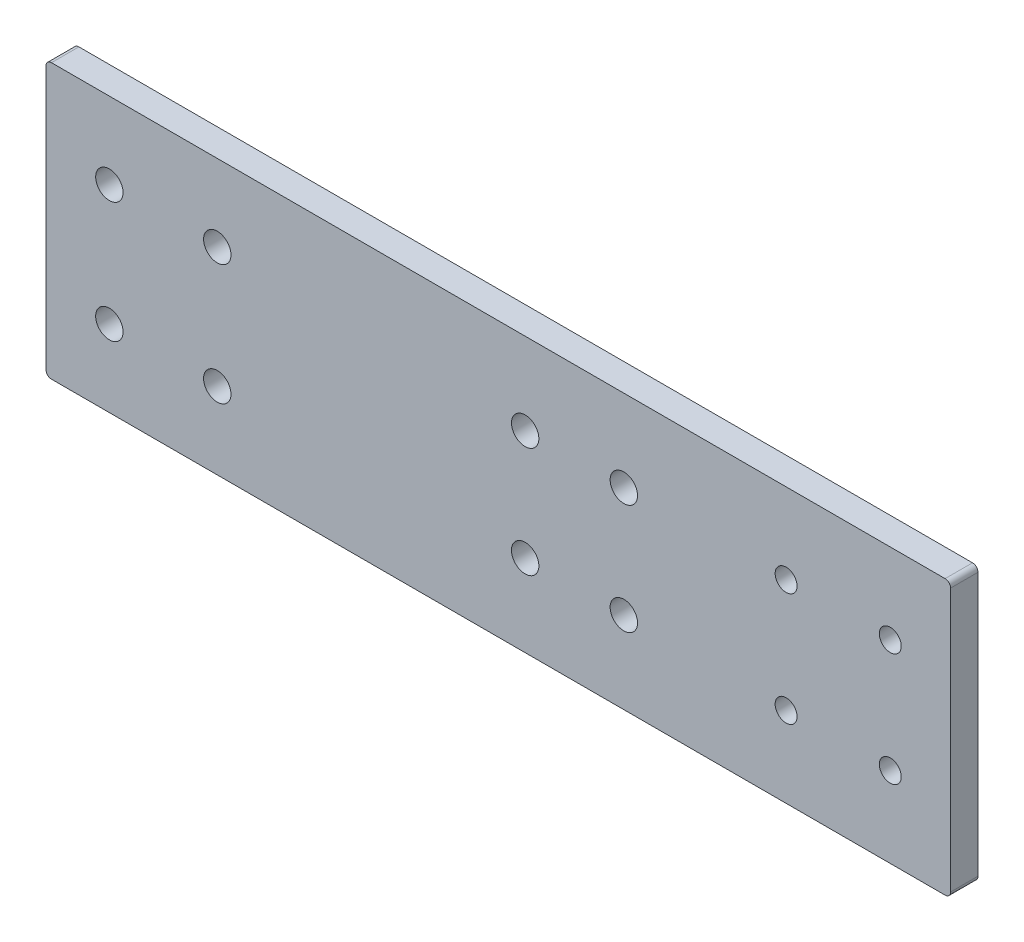
ISO-10303-21;
HEADER;
FILE_DESCRIPTION(('STEP AP214'),'2;1');
FILE_NAME('part.step','',(''),(''),'','','');
FILE_SCHEMA(('AUTOMOTIVE_DESIGN { 1 0 10303 214 1 1 1 1 }'));
ENDSEC;
DATA;
#1=APPLICATION_CONTEXT('core data for automotive mechanical design processes');
#2=APPLICATION_PROTOCOL_DEFINITION('international standard','automotive_design',2000,#1);
#3=PRODUCT_CONTEXT('',#1,'mechanical');
#4=PRODUCT('Part','Part','',(#3));
#5=PRODUCT_RELATED_PRODUCT_CATEGORY('part','',(#4));
#6=PRODUCT_DEFINITION_FORMATION('','',#4);
#7=PRODUCT_DEFINITION_CONTEXT('part definition',#1,'design');
#8=PRODUCT_DEFINITION('design','',#6,#7);
#9=PRODUCT_DEFINITION_SHAPE('','',#8);
#10=(LENGTH_UNIT() NAMED_UNIT(*) SI_UNIT(.MILLI.,.METRE.));
#11=(NAMED_UNIT(*) PLANE_ANGLE_UNIT() SI_UNIT($,.RADIAN.));
#12=(NAMED_UNIT(*) SI_UNIT($,.STERADIAN.) SOLID_ANGLE_UNIT());
#13=UNCERTAINTY_MEASURE_WITH_UNIT(LENGTH_MEASURE(1.E-05),#10,'distance_accuracy_value','');
#14=(GEOMETRIC_REPRESENTATION_CONTEXT(3) GLOBAL_UNCERTAINTY_ASSIGNED_CONTEXT((#13)) GLOBAL_UNIT_ASSIGNED_CONTEXT((#10,
#11,#12)) REPRESENTATION_CONTEXT('',''));
#15=CARTESIAN_POINT('',(0.,0.,0.));
#16=DIRECTION('',(0.,0.,1.));
#17=DIRECTION('',(1.,0.,0.));
#18=AXIS2_PLACEMENT_3D('',#15,#16,#17);
#19=CARTESIAN_POINT('',(1.,48.9999999999999,5.));
#20=DIRECTION('',(0.,0.,-1.));
#21=DIRECTION('',(-1.,0.,0.));
#22=AXIS2_PLACEMENT_3D('',#19,#20,#21);
#23=PLANE('',#22);
#24=CARTESIAN_POINT('',(1.,48.9999999999999,5.));
#25=DIRECTION('',(0.,0.,1.));
#26=DIRECTION('',(-1.,0.,0.));
#27=AXIS2_PLACEMENT_3D('',#24,#25,#26);
#28=CIRCLE('',#27,1.00000000000002);
#29=CARTESIAN_POINT('',(0.999999999999999,50.,5.));
#30=VERTEX_POINT('',#29);
#31=CARTESIAN_POINT('',(0.,48.9999999999999,5.));
#32=VERTEX_POINT('',#31);
#33=EDGE_CURVE('E145',#30,#32,#28,.T.);
#34=ORIENTED_EDGE('',*,*,#33,.T.);
#35=DIRECTION('',(0.,-1.,0.));
#36=VECTOR('',#35,1.);
#37=CARTESIAN_POINT('',(0.,1.,5.));
#38=LINE('',#37,#36);
#39=CARTESIAN_POINT('',(0.,1.,5.));
#40=VERTEX_POINT('',#39);
#41=EDGE_CURVE('E93',#32,#40,#38,.T.);
#42=ORIENTED_EDGE('',*,*,#41,.T.);
#43=CARTESIAN_POINT('',(0.999999999999999,1.,5.));
#44=DIRECTION('',(0.,0.,1.));
#45=DIRECTION('',(-1.,0.,0.));
#46=AXIS2_PLACEMENT_3D('',#43,#44,#45);
#47=CIRCLE('',#46,1.);
#48=CARTESIAN_POINT('',(0.999999999999999,0.,5.));
#49=VERTEX_POINT('',#48);
#50=EDGE_CURVE('E160',#40,#49,#47,.T.);
#51=ORIENTED_EDGE('',*,*,#50,.T.);
#52=DIRECTION('',(1.,0.,0.));
#53=VECTOR('',#52,1.);
#54=CARTESIAN_POINT('',(0.999999999999999,0.,5.));
#55=LINE('',#54,#53);
#56=CARTESIAN_POINT('',(164.,0.,5.));
#57=VERTEX_POINT('',#56);
#58=EDGE_CURVE('E173',#49,#57,#55,.T.);
#59=ORIENTED_EDGE('',*,*,#58,.T.);
#60=CARTESIAN_POINT('',(164.,1.,5.));
#61=DIRECTION('',(0.,0.,1.));
#62=DIRECTION('',(1.,0.,0.));
#63=AXIS2_PLACEMENT_3D('',#60,#61,#62);
#64=CIRCLE('',#63,1.);
#65=CARTESIAN_POINT('',(165.,1.,5.));
#66=VERTEX_POINT('',#65);
#67=EDGE_CURVE('E112',#57,#66,#64,.T.);
#68=ORIENTED_EDGE('',*,*,#67,.T.);
#69=DIRECTION('',(0.,1.,0.));
#70=VECTOR('',#69,1.);
#71=CARTESIAN_POINT('',(165.,1.,5.));
#72=LINE('',#71,#70);
#73=CARTESIAN_POINT('',(165.,49.,5.));
#74=VERTEX_POINT('',#73);
#75=EDGE_CURVE('E106',#66,#74,#72,.T.);
#76=ORIENTED_EDGE('',*,*,#75,.T.);
#77=CARTESIAN_POINT('',(164.,49.,5.));
#78=DIRECTION('',(0.,0.,1.));
#79=DIRECTION('',(-1.,0.,0.));
#80=AXIS2_PLACEMENT_3D('',#77,#78,#79);
#81=CIRCLE('',#80,1.);
#82=CARTESIAN_POINT('',(164.,50.,5.));
#83=VERTEX_POINT('',#82);
#84=EDGE_CURVE('E110',#74,#83,#81,.T.);
#85=ORIENTED_EDGE('',*,*,#84,.T.);
#86=DIRECTION('',(-1.,0.,0.));
#87=VECTOR('',#86,1.);
#88=CARTESIAN_POINT('',(0.999999999999999,50.,5.));
#89=LINE('',#88,#87);
#90=EDGE_CURVE('E50',#83,#30,#89,.T.);
#91=ORIENTED_EDGE('',*,*,#90,.T.);
#92=EDGE_LOOP('',(#34,#42,#51,#59,#68,#76,#85,#91));
#93=FACE_BOUND('',#92,.T.);
#94=CARTESIAN_POINT('',(135.,35.3142857142857,5.));
#95=DIRECTION('',(0.,0.,1.));
#96=DIRECTION('',(1.,0.,0.));
#97=AXIS2_PLACEMENT_3D('',#94,#95,#96);
#98=CIRCLE('',#97,2.);
#99=CARTESIAN_POINT('',(137.,35.3142857142857,5.));
#100=VERTEX_POINT('',#99);
#101=EDGE_CURVE('E134',#100,#100,#98,.T.);
#102=ORIENTED_EDGE('',*,*,#101,.F.);
#103=EDGE_LOOP('',(#102));
#104=FACE_BOUND('',#103,.T.);
#105=CARTESIAN_POINT('',(135.,14.6857142857143,5.));
#106=DIRECTION('',(0.,0.,1.));
#107=DIRECTION('',(-1.,0.,0.));
#108=AXIS2_PLACEMENT_3D('',#105,#106,#107);
#109=CIRCLE('',#108,2.);
#110=CARTESIAN_POINT('',(133.,14.6857142857143,5.));
#111=VERTEX_POINT('',#110);
#112=EDGE_CURVE('E182',#111,#111,#109,.T.);
#113=ORIENTED_EDGE('',*,*,#112,.F.);
#114=EDGE_LOOP('',(#113));
#115=FACE_BOUND('',#114,.T.);
#116=CARTESIAN_POINT('',(154.,14.6857142857143,5.));
#117=DIRECTION('',(0.,0.,1.));
#118=DIRECTION('',(1.,0.,0.));
#119=AXIS2_PLACEMENT_3D('',#116,#117,#118);
#120=CIRCLE('',#119,2.);
#121=CARTESIAN_POINT('',(156.,14.6857142857143,5.));
#122=VERTEX_POINT('',#121);
#123=EDGE_CURVE('E188',#122,#122,#120,.T.);
#124=ORIENTED_EDGE('',*,*,#123,.F.);
#125=EDGE_LOOP('',(#124));
#126=FACE_BOUND('',#125,.T.);
#127=CARTESIAN_POINT('',(154.,35.3142857142857,5.));
#128=DIRECTION('',(0.,0.,1.));
#129=DIRECTION('',(-1.,0.,0.));
#130=AXIS2_PLACEMENT_3D('',#127,#128,#129);
#131=CIRCLE('',#130,2.);
#132=CARTESIAN_POINT('',(152.,35.3142857142857,5.));
#133=VERTEX_POINT('',#132);
#134=EDGE_CURVE('E194',#133,#133,#131,.T.);
#135=ORIENTED_EDGE('',*,*,#134,.F.);
#136=EDGE_LOOP('',(#135));
#137=FACE_BOUND('',#136,.T.);
#138=CARTESIAN_POINT('',(105.4,35.0588235294118,5.));
#139=DIRECTION('',(0.,0.,1.));
#140=DIRECTION('',(1.,0.,0.));
#141=AXIS2_PLACEMENT_3D('',#138,#139,#140);
#142=CIRCLE('',#141,2.5);
#143=CARTESIAN_POINT('',(107.9,35.0588235294118,5.));
#144=VERTEX_POINT('',#143);
#145=EDGE_CURVE('E200',#144,#144,#142,.T.);
#146=ORIENTED_EDGE('',*,*,#145,.F.);
#147=EDGE_LOOP('',(#146));
#148=FACE_BOUND('',#147,.T.);
#149=CARTESIAN_POINT('',(105.4,14.9411764705882,5.));
#150=DIRECTION('',(0.,0.,1.));
#151=DIRECTION('',(-1.,0.,0.));
#152=AXIS2_PLACEMENT_3D('',#149,#150,#151);
#153=CIRCLE('',#152,2.5);
#154=CARTESIAN_POINT('',(102.9,14.9411764705882,5.));
#155=VERTEX_POINT('',#154);
#156=EDGE_CURVE('E206',#155,#155,#153,.T.);
#157=ORIENTED_EDGE('',*,*,#156,.F.);
#158=EDGE_LOOP('',(#157));
#159=FACE_BOUND('',#158,.T.);
#160=CARTESIAN_POINT('',(87.4,14.9411764705882,5.));
#161=DIRECTION('',(0.,0.,1.));
#162=DIRECTION('',(1.,0.,0.));
#163=AXIS2_PLACEMENT_3D('',#160,#161,#162);
#164=CIRCLE('',#163,2.5);
#165=CARTESIAN_POINT('',(89.9,14.9411764705882,5.));
#166=VERTEX_POINT('',#165);
#167=EDGE_CURVE('E212',#166,#166,#164,.T.);
#168=ORIENTED_EDGE('',*,*,#167,.F.);
#169=EDGE_LOOP('',(#168));
#170=FACE_BOUND('',#169,.T.);
#171=CARTESIAN_POINT('',(87.4,35.0588235294118,5.));
#172=DIRECTION('',(0.,0.,1.));
#173=DIRECTION('',(-1.,0.,0.));
#174=AXIS2_PLACEMENT_3D('',#171,#172,#173);
#175=CIRCLE('',#174,2.5);
#176=CARTESIAN_POINT('',(84.9,35.0588235294118,5.));
#177=VERTEX_POINT('',#176);
#178=EDGE_CURVE('E218',#177,#177,#175,.T.);
#179=ORIENTED_EDGE('',*,*,#178,.F.);
#180=EDGE_LOOP('',(#179));
#181=FACE_BOUND('',#180,.T.);
#182=CARTESIAN_POINT('',(11.5578947368421,36.,5.));
#183=DIRECTION('',(0.,0.,1.));
#184=DIRECTION('',(1.,0.,0.));
#185=AXIS2_PLACEMENT_3D('',#182,#183,#184);
#186=CIRCLE('',#185,2.5);
#187=CARTESIAN_POINT('',(14.0578947368421,36.,5.));
#188=VERTEX_POINT('',#187);
#189=EDGE_CURVE('E224',#188,#188,#186,.T.);
#190=ORIENTED_EDGE('',*,*,#189,.F.);
#191=EDGE_LOOP('',(#190));
#192=FACE_BOUND('',#191,.T.);
#193=CARTESIAN_POINT('',(11.5578947368421,14.,5.));
#194=DIRECTION('',(0.,0.,1.));
#195=DIRECTION('',(-1.,0.,0.));
#196=AXIS2_PLACEMENT_3D('',#193,#194,#195);
#197=CIRCLE('',#196,2.5);
#198=CARTESIAN_POINT('',(9.05789473684213,14.,5.));
#199=VERTEX_POINT('',#198);
#200=EDGE_CURVE('E230',#199,#199,#197,.T.);
#201=ORIENTED_EDGE('',*,*,#200,.F.);
#202=EDGE_LOOP('',(#201));
#203=FACE_BOUND('',#202,.T.);
#204=CARTESIAN_POINT('',(31.2421052631579,14.,5.));
#205=DIRECTION('',(0.,0.,1.));
#206=DIRECTION('',(1.,0.,0.));
#207=AXIS2_PLACEMENT_3D('',#204,#205,#206);
#208=CIRCLE('',#207,2.5);
#209=CARTESIAN_POINT('',(33.7421052631579,14.,5.));
#210=VERTEX_POINT('',#209);
#211=EDGE_CURVE('E236',#210,#210,#208,.T.);
#212=ORIENTED_EDGE('',*,*,#211,.F.);
#213=EDGE_LOOP('',(#212));
#214=FACE_BOUND('',#213,.T.);
#215=CARTESIAN_POINT('',(31.2421052631579,36.,5.));
#216=DIRECTION('',(0.,0.,1.));
#217=DIRECTION('',(-1.,0.,0.));
#218=AXIS2_PLACEMENT_3D('',#215,#216,#217);
#219=CIRCLE('',#218,2.5);
#220=CARTESIAN_POINT('',(28.7421052631579,36.,5.));
#221=VERTEX_POINT('',#220);
#222=EDGE_CURVE('E242',#221,#221,#219,.T.);
#223=ORIENTED_EDGE('',*,*,#222,.F.);
#224=EDGE_LOOP('',(#223));
#225=FACE_BOUND('',#224,.T.);
#226=ADVANCED_FACE('F33',(#93,#104,#115,#126,#137,#148,#159,#170,#181,#192,#203,#214,#225),#23,.F.);
#227=CARTESIAN_POINT('',(1.,48.9999999999999,0.));
#228=DIRECTION('',(0.,0.,-1.));
#229=DIRECTION('',(-1.,0.,0.));
#230=AXIS2_PLACEMENT_3D('',#227,#228,#229);
#231=PLANE('',#230);
#232=CARTESIAN_POINT('',(31.2421052631579,14.,0.));
#233=DIRECTION('',(0.,0.,1.));
#234=DIRECTION('',(1.,0.,0.));
#235=AXIS2_PLACEMENT_3D('',#232,#233,#234);
#236=CIRCLE('',#235,2.5);
#237=CARTESIAN_POINT('',(33.7421052631579,14.,0.));
#238=VERTEX_POINT('',#237);
#239=EDGE_CURVE('E239',#238,#238,#236,.T.);
#240=ORIENTED_EDGE('',*,*,#239,.T.);
#241=EDGE_LOOP('',(#240));
#242=FACE_BOUND('',#241,.T.);
#243=CARTESIAN_POINT('',(11.5578947368421,36.,0.));
#244=DIRECTION('',(0.,0.,1.));
#245=DIRECTION('',(1.,0.,0.));
#246=AXIS2_PLACEMENT_3D('',#243,#244,#245);
#247=CIRCLE('',#246,2.5);
#248=CARTESIAN_POINT('',(14.0578947368421,36.,0.));
#249=VERTEX_POINT('',#248);
#250=EDGE_CURVE('E227',#249,#249,#247,.T.);
#251=ORIENTED_EDGE('',*,*,#250,.T.);
#252=EDGE_LOOP('',(#251));
#253=FACE_BOUND('',#252,.T.);
#254=CARTESIAN_POINT('',(87.4,14.9411764705882,0.));
#255=DIRECTION('',(0.,0.,1.));
#256=DIRECTION('',(1.,0.,0.));
#257=AXIS2_PLACEMENT_3D('',#254,#255,#256);
#258=CIRCLE('',#257,2.5);
#259=CARTESIAN_POINT('',(89.9,14.9411764705882,0.));
#260=VERTEX_POINT('',#259);
#261=EDGE_CURVE('E215',#260,#260,#258,.T.);
#262=ORIENTED_EDGE('',*,*,#261,.T.);
#263=EDGE_LOOP('',(#262));
#264=FACE_BOUND('',#263,.T.);
#265=CARTESIAN_POINT('',(105.4,35.0588235294118,0.));
#266=DIRECTION('',(0.,0.,1.));
#267=DIRECTION('',(1.,0.,0.));
#268=AXIS2_PLACEMENT_3D('',#265,#266,#267);
#269=CIRCLE('',#268,2.5);
#270=CARTESIAN_POINT('',(107.9,35.0588235294118,0.));
#271=VERTEX_POINT('',#270);
#272=EDGE_CURVE('E203',#271,#271,#269,.T.);
#273=ORIENTED_EDGE('',*,*,#272,.T.);
#274=EDGE_LOOP('',(#273));
#275=FACE_BOUND('',#274,.T.);
#276=CARTESIAN_POINT('',(154.,14.6857142857143,0.));
#277=DIRECTION('',(0.,0.,1.));
#278=DIRECTION('',(1.,0.,0.));
#279=AXIS2_PLACEMENT_3D('',#276,#277,#278);
#280=CIRCLE('',#279,2.);
#281=CARTESIAN_POINT('',(156.,14.6857142857143,0.));
#282=VERTEX_POINT('',#281);
#283=EDGE_CURVE('E191',#282,#282,#280,.T.);
#284=ORIENTED_EDGE('',*,*,#283,.T.);
#285=EDGE_LOOP('',(#284));
#286=FACE_BOUND('',#285,.T.);
#287=CARTESIAN_POINT('',(135.,35.3142857142857,0.));
#288=DIRECTION('',(0.,0.,1.));
#289=DIRECTION('',(1.,0.,0.));
#290=AXIS2_PLACEMENT_3D('',#287,#288,#289);
#291=CIRCLE('',#290,2.);
#292=CARTESIAN_POINT('',(137.,35.3142857142857,0.));
#293=VERTEX_POINT('',#292);
#294=EDGE_CURVE('E179',#293,#293,#291,.T.);
#295=ORIENTED_EDGE('',*,*,#294,.T.);
#296=EDGE_LOOP('',(#295));
#297=FACE_BOUND('',#296,.T.);
#298=CARTESIAN_POINT('',(1.,48.9999999999999,0.));
#299=DIRECTION('',(0.,0.,1.));
#300=DIRECTION('',(-1.,0.,0.));
#301=AXIS2_PLACEMENT_3D('',#298,#299,#300);
#302=CIRCLE('',#301,1.00000000000002);
#303=CARTESIAN_POINT('',(0.999999999999999,50.,0.));
#304=VERTEX_POINT('',#303);
#305=CARTESIAN_POINT('',(0.,48.9999999999999,0.));
#306=VERTEX_POINT('',#305);
#307=EDGE_CURVE('E130',#304,#306,#302,.T.);
#308=ORIENTED_EDGE('',*,*,#307,.F.);
#309=DIRECTION('',(-1.,0.,0.));
#310=VECTOR('',#309,1.);
#311=CARTESIAN_POINT('',(0.999999999999999,50.,0.));
#312=LINE('',#311,#310);
#313=CARTESIAN_POINT('',(164.,50.,0.));
#314=VERTEX_POINT('',#313);
#315=EDGE_CURVE('E85',#314,#304,#312,.T.);
#316=ORIENTED_EDGE('',*,*,#315,.F.);
#317=CARTESIAN_POINT('',(164.,49.,0.));
#318=DIRECTION('',(0.,0.,1.));
#319=DIRECTION('',(-1.,0.,0.));
#320=AXIS2_PLACEMENT_3D('',#317,#318,#319);
#321=CIRCLE('',#320,1.);
#322=CARTESIAN_POINT('',(165.,49.,0.));
#323=VERTEX_POINT('',#322);
#324=EDGE_CURVE('E79',#323,#314,#321,.T.);
#325=ORIENTED_EDGE('',*,*,#324,.F.);
#326=DIRECTION('',(0.,1.,0.));
#327=VECTOR('',#326,1.);
#328=CARTESIAN_POINT('',(165.,1.,0.));
#329=LINE('',#328,#327);
#330=CARTESIAN_POINT('',(165.,1.,0.));
#331=VERTEX_POINT('',#330);
#332=EDGE_CURVE('E120',#331,#323,#329,.T.);
#333=ORIENTED_EDGE('',*,*,#332,.F.);
#334=CARTESIAN_POINT('',(164.,1.,0.));
#335=DIRECTION('',(0.,0.,1.));
#336=DIRECTION('',(1.,0.,0.));
#337=AXIS2_PLACEMENT_3D('',#334,#335,#336);
#338=CIRCLE('',#337,1.);
#339=CARTESIAN_POINT('',(164.,0.,0.));
#340=VERTEX_POINT('',#339);
#341=EDGE_CURVE('E140',#340,#331,#338,.T.);
#342=ORIENTED_EDGE('',*,*,#341,.F.);
#343=DIRECTION('',(1.,0.,0.));
#344=VECTOR('',#343,1.);
#345=CARTESIAN_POINT('',(0.999999999999999,0.,0.));
#346=LINE('',#345,#344);
#347=CARTESIAN_POINT('',(0.999999999999999,0.,0.));
#348=VERTEX_POINT('',#347);
#349=EDGE_CURVE('E138',#348,#340,#346,.T.);
#350=ORIENTED_EDGE('',*,*,#349,.F.);
#351=CARTESIAN_POINT('',(0.999999999999999,1.,0.));
#352=DIRECTION('',(0.,0.,1.));
#353=DIRECTION('',(-1.,0.,0.));
#354=AXIS2_PLACEMENT_3D('',#351,#352,#353);
#355=CIRCLE('',#354,1.);
#356=CARTESIAN_POINT('',(0.,1.,0.));
#357=VERTEX_POINT('',#356);
#358=EDGE_CURVE('E136',#357,#348,#355,.T.);
#359=ORIENTED_EDGE('',*,*,#358,.F.);
#360=DIRECTION('',(0.,-1.,0.));
#361=VECTOR('',#360,1.);
#362=CARTESIAN_POINT('',(0.,1.,0.));
#363=LINE('',#362,#361);
#364=EDGE_CURVE('E133',#306,#357,#363,.T.);
#365=ORIENTED_EDGE('',*,*,#364,.F.);
#366=EDGE_LOOP('',(#308,#316,#325,#333,#342,#350,#359,#365));
#367=FACE_BOUND('',#366,.T.);
#368=CARTESIAN_POINT('',(135.,14.6857142857143,0.));
#369=DIRECTION('',(0.,0.,1.));
#370=DIRECTION('',(-1.,0.,0.));
#371=AXIS2_PLACEMENT_3D('',#368,#369,#370);
#372=CIRCLE('',#371,2.);
#373=CARTESIAN_POINT('',(133.,14.6857142857143,0.));
#374=VERTEX_POINT('',#373);
#375=EDGE_CURVE('E185',#374,#374,#372,.T.);
#376=ORIENTED_EDGE('',*,*,#375,.T.);
#377=EDGE_LOOP('',(#376));
#378=FACE_BOUND('',#377,.T.);
#379=CARTESIAN_POINT('',(154.,35.3142857142857,0.));
#380=DIRECTION('',(0.,0.,1.));
#381=DIRECTION('',(-1.,0.,0.));
#382=AXIS2_PLACEMENT_3D('',#379,#380,#381);
#383=CIRCLE('',#382,2.);
#384=CARTESIAN_POINT('',(152.,35.3142857142857,0.));
#385=VERTEX_POINT('',#384);
#386=EDGE_CURVE('E197',#385,#385,#383,.T.);
#387=ORIENTED_EDGE('',*,*,#386,.T.);
#388=EDGE_LOOP('',(#387));
#389=FACE_BOUND('',#388,.T.);
#390=CARTESIAN_POINT('',(105.4,14.9411764705882,0.));
#391=DIRECTION('',(0.,0.,1.));
#392=DIRECTION('',(-1.,0.,0.));
#393=AXIS2_PLACEMENT_3D('',#390,#391,#392);
#394=CIRCLE('',#393,2.5);
#395=CARTESIAN_POINT('',(102.9,14.9411764705882,0.));
#396=VERTEX_POINT('',#395);
#397=EDGE_CURVE('E209',#396,#396,#394,.T.);
#398=ORIENTED_EDGE('',*,*,#397,.T.);
#399=EDGE_LOOP('',(#398));
#400=FACE_BOUND('',#399,.T.);
#401=CARTESIAN_POINT('',(87.4,35.0588235294118,0.));
#402=DIRECTION('',(0.,0.,1.));
#403=DIRECTION('',(-1.,0.,0.));
#404=AXIS2_PLACEMENT_3D('',#401,#402,#403);
#405=CIRCLE('',#404,2.5);
#406=CARTESIAN_POINT('',(84.9,35.0588235294118,0.));
#407=VERTEX_POINT('',#406);
#408=EDGE_CURVE('E221',#407,#407,#405,.T.);
#409=ORIENTED_EDGE('',*,*,#408,.T.);
#410=EDGE_LOOP('',(#409));
#411=FACE_BOUND('',#410,.T.);
#412=CARTESIAN_POINT('',(11.5578947368421,14.,0.));
#413=DIRECTION('',(0.,0.,1.));
#414=DIRECTION('',(-1.,0.,0.));
#415=AXIS2_PLACEMENT_3D('',#412,#413,#414);
#416=CIRCLE('',#415,2.5);
#417=CARTESIAN_POINT('',(9.05789473684213,14.,0.));
#418=VERTEX_POINT('',#417);
#419=EDGE_CURVE('E233',#418,#418,#416,.T.);
#420=ORIENTED_EDGE('',*,*,#419,.T.);
#421=EDGE_LOOP('',(#420));
#422=FACE_BOUND('',#421,.T.);
#423=CARTESIAN_POINT('',(31.2421052631579,36.,0.));
#424=DIRECTION('',(0.,0.,1.));
#425=DIRECTION('',(-1.,0.,0.));
#426=AXIS2_PLACEMENT_3D('',#423,#424,#425);
#427=CIRCLE('',#426,2.5);
#428=CARTESIAN_POINT('',(28.7421052631579,36.,0.));
#429=VERTEX_POINT('',#428);
#430=EDGE_CURVE('E245',#429,#429,#427,.T.);
#431=ORIENTED_EDGE('',*,*,#430,.T.);
#432=EDGE_LOOP('',(#431));
#433=FACE_BOUND('',#432,.T.);
#434=ADVANCED_FACE('F164',(#242,#253,#264,#275,#286,#297,#367,#378,#389,#400,#411,#422,#433),
#231,.T.);
#435=CARTESIAN_POINT('',(1.,48.9999999999999,5.));
#436=DIRECTION('',(0.,0.,-1.));
#437=DIRECTION('',(-1.,0.,0.));
#438=AXIS2_PLACEMENT_3D('',#435,#436,#437);
#439=CYLINDRICAL_SURFACE('',#438,1.00000000000002);
#440=ORIENTED_EDGE('',*,*,#307,.T.);
#441=DIRECTION('',(0.,0.,-1.));
#442=VECTOR('',#441,1.);
#443=CARTESIAN_POINT('',(0.,48.9999999999999,5.));
#444=LINE('',#443,#442);
#445=EDGE_CURVE('E11',#32,#306,#444,.T.);
#446=ORIENTED_EDGE('',*,*,#445,.F.);
#447=ORIENTED_EDGE('',*,*,#33,.F.);
#448=DIRECTION('',(0.,0.,-1.));
#449=VECTOR('',#448,1.);
#450=CARTESIAN_POINT('',(0.999999999999999,50.,5.));
#451=LINE('',#450,#449);
#452=EDGE_CURVE('E126',#30,#304,#451,.T.);
#453=ORIENTED_EDGE('',*,*,#452,.T.);
#454=EDGE_LOOP('',(#440,#446,#447,#453));
#455=FACE_BOUND('',#454,.T.);
#456=ADVANCED_FACE('F35',(#455),#439,.T.);
#457=CARTESIAN_POINT('',(0.,1.,5.));
#458=DIRECTION('',(1.,0.,0.));
#459=DIRECTION('',(0.,1.,0.));
#460=AXIS2_PLACEMENT_3D('',#457,#458,#459);
#461=PLANE('',#460);
#462=ORIENTED_EDGE('',*,*,#364,.T.);
#463=DIRECTION('',(0.,0.,-1.));
#464=VECTOR('',#463,1.);
#465=CARTESIAN_POINT('',(0.,1.,5.));
#466=LINE('',#465,#464);
#467=EDGE_CURVE('E42',#40,#357,#466,.T.);
#468=ORIENTED_EDGE('',*,*,#467,.F.);
#469=ORIENTED_EDGE('',*,*,#41,.F.);
#470=ORIENTED_EDGE('',*,*,#445,.T.);
#471=EDGE_LOOP('',(#462,#468,#469,#470));
#472=FACE_BOUND('',#471,.T.);
#473=ADVANCED_FACE('F277',(#472),#461,.F.);
#474=CARTESIAN_POINT('',(0.999999999999999,1.,5.));
#475=DIRECTION('',(0.,0.,-1.));
#476=DIRECTION('',(-1.,0.,0.));
#477=AXIS2_PLACEMENT_3D('',#474,#475,#476);
#478=CYLINDRICAL_SURFACE('',#477,1.);
#479=ORIENTED_EDGE('',*,*,#358,.T.);
#480=DIRECTION('',(0.,0.,-1.));
#481=VECTOR('',#480,1.);
#482=CARTESIAN_POINT('',(0.999999999999999,0.,5.));
#483=LINE('',#482,#481);
#484=EDGE_CURVE('E152',#49,#348,#483,.T.);
#485=ORIENTED_EDGE('',*,*,#484,.F.);
#486=ORIENTED_EDGE('',*,*,#50,.F.);
#487=ORIENTED_EDGE('',*,*,#467,.T.);
#488=EDGE_LOOP('',(#479,#485,#486,#487));
#489=FACE_BOUND('',#488,.T.);
#490=ADVANCED_FACE('F158',(#489),#478,.T.);
#491=CARTESIAN_POINT('',(0.999999999999999,0.,5.));
#492=DIRECTION('',(0.,1.,0.));
#493=DIRECTION('',(-1.,0.,0.));
#494=AXIS2_PLACEMENT_3D('',#491,#492,#493);
#495=PLANE('',#494);
#496=ORIENTED_EDGE('',*,*,#349,.T.);
#497=DIRECTION('',(0.,0.,-1.));
#498=VECTOR('',#497,1.);
#499=CARTESIAN_POINT('',(164.,0.,5.));
#500=LINE('',#499,#498);
#501=EDGE_CURVE('E149',#57,#340,#500,.T.);
#502=ORIENTED_EDGE('',*,*,#501,.F.);
#503=ORIENTED_EDGE('',*,*,#58,.F.);
#504=ORIENTED_EDGE('',*,*,#484,.T.);
#505=EDGE_LOOP('',(#496,#502,#503,#504));
#506=FACE_BOUND('',#505,.T.);
#507=ADVANCED_FACE('F169',(#506),#495,.F.);
#508=CARTESIAN_POINT('',(164.,1.,5.));
#509=DIRECTION('',(0.,0.,-1.));
#510=DIRECTION('',(-1.,0.,0.));
#511=AXIS2_PLACEMENT_3D('',#508,#509,#510);
#512=CYLINDRICAL_SURFACE('',#511,1.);
#513=ORIENTED_EDGE('',*,*,#341,.T.);
#514=DIRECTION('',(0.,0.,-1.));
#515=VECTOR('',#514,1.);
#516=CARTESIAN_POINT('',(165.,1.,5.));
#517=LINE('',#516,#515);
#518=EDGE_CURVE('E121',#66,#331,#517,.T.);
#519=ORIENTED_EDGE('',*,*,#518,.F.);
#520=ORIENTED_EDGE('',*,*,#67,.F.);
#521=ORIENTED_EDGE('',*,*,#501,.T.);
#522=EDGE_LOOP('',(#513,#519,#520,#521));
#523=FACE_BOUND('',#522,.T.);
#524=ADVANCED_FACE('F172',(#523),#512,.T.);
#525=CARTESIAN_POINT('',(165.,1.,5.));
#526=DIRECTION('',(-1.,0.,0.));
#527=DIRECTION('',(0.,0.,1.));
#528=AXIS2_PLACEMENT_3D('',#525,#526,#527);
#529=PLANE('',#528);
#530=ORIENTED_EDGE('',*,*,#332,.T.);
#531=DIRECTION('',(0.,0.,-1.));
#532=VECTOR('',#531,1.);
#533=CARTESIAN_POINT('',(165.,49.,5.));
#534=LINE('',#533,#532);
#535=EDGE_CURVE('E117',#74,#323,#534,.T.);
#536=ORIENTED_EDGE('',*,*,#535,.F.);
#537=ORIENTED_EDGE('',*,*,#75,.F.);
#538=ORIENTED_EDGE('',*,*,#518,.T.);
#539=EDGE_LOOP('',(#530,#536,#537,#538));
#540=FACE_BOUND('',#539,.T.);
#541=ADVANCED_FACE('F118',(#540),#529,.F.);
#542=CARTESIAN_POINT('',(164.,49.,5.));
#543=DIRECTION('',(0.,0.,-1.));
#544=DIRECTION('',(-1.,0.,0.));
#545=AXIS2_PLACEMENT_3D('',#542,#543,#544);
#546=CYLINDRICAL_SURFACE('',#545,1.);
#547=ORIENTED_EDGE('',*,*,#324,.T.);
#548=DIRECTION('',(0.,0.,-1.));
#549=VECTOR('',#548,1.);
#550=CARTESIAN_POINT('',(164.,50.,5.));
#551=LINE('',#550,#549);
#552=EDGE_CURVE('E122',#83,#314,#551,.T.);
#553=ORIENTED_EDGE('',*,*,#552,.F.);
#554=ORIENTED_EDGE('',*,*,#84,.F.);
#555=ORIENTED_EDGE('',*,*,#535,.T.);
#556=EDGE_LOOP('',(#547,#553,#554,#555));
#557=FACE_BOUND('',#556,.T.);
#558=ADVANCED_FACE('F124',(#557),#546,.T.);
#559=CARTESIAN_POINT('',(0.999999999999999,50.,5.));
#560=DIRECTION('',(0.,-1.,0.));
#561=DIRECTION('',(1.,0.,0.));
#562=AXIS2_PLACEMENT_3D('',#559,#560,#561);
#563=PLANE('',#562);
#564=ORIENTED_EDGE('',*,*,#315,.T.);
#565=ORIENTED_EDGE('',*,*,#452,.F.);
#566=ORIENTED_EDGE('',*,*,#90,.F.);
#567=ORIENTED_EDGE('',*,*,#552,.T.);
#568=EDGE_LOOP('',(#564,#565,#566,#567));
#569=FACE_BOUND('',#568,.T.);
#570=ADVANCED_FACE('F265',(#569),#563,.F.);
#571=CARTESIAN_POINT('',(135.,35.3142857142857,5.));
#572=DIRECTION('',(0.,0.,-1.));
#573=DIRECTION('',(-1.,0.,0.));
#574=AXIS2_PLACEMENT_3D('',#571,#572,#573);
#575=CYLINDRICAL_SURFACE('',#574,2.);
#576=ORIENTED_EDGE('',*,*,#101,.T.);
#577=EDGE_LOOP('',(#576));
#578=FACE_BOUND('',#577,.T.);
#579=ORIENTED_EDGE('',*,*,#294,.F.);
#580=EDGE_LOOP('',(#579));
#581=FACE_BOUND('',#580,.T.);
#582=ADVANCED_FACE('F262',(#578,#581),#575,.F.);
#583=CARTESIAN_POINT('',(135.,14.6857142857143,5.));
#584=DIRECTION('',(0.,0.,-1.));
#585=DIRECTION('',(-1.,0.,0.));
#586=AXIS2_PLACEMENT_3D('',#583,#584,#585);
#587=CYLINDRICAL_SURFACE('',#586,2.);
#588=ORIENTED_EDGE('',*,*,#112,.T.);
#589=EDGE_LOOP('',(#588));
#590=FACE_BOUND('',#589,.T.);
#591=ORIENTED_EDGE('',*,*,#375,.F.);
#592=EDGE_LOOP('',(#591));
#593=FACE_BOUND('',#592,.T.);
#594=ADVANCED_FACE('F341',(#590,#593),#587,.F.);
#595=CARTESIAN_POINT('',(154.,14.6857142857143,5.));
#596=DIRECTION('',(0.,0.,-1.));
#597=DIRECTION('',(-1.,0.,0.));
#598=AXIS2_PLACEMENT_3D('',#595,#596,#597);
#599=CYLINDRICAL_SURFACE('',#598,2.);
#600=ORIENTED_EDGE('',*,*,#123,.T.);
#601=EDGE_LOOP('',(#600));
#602=FACE_BOUND('',#601,.T.);
#603=ORIENTED_EDGE('',*,*,#283,.F.);
#604=EDGE_LOOP('',(#603));
#605=FACE_BOUND('',#604,.T.);
#606=ADVANCED_FACE('F349',(#602,#605),#599,.F.);
#607=CARTESIAN_POINT('',(154.,35.3142857142857,5.));
#608=DIRECTION('',(0.,0.,-1.));
#609=DIRECTION('',(-1.,0.,0.));
#610=AXIS2_PLACEMENT_3D('',#607,#608,#609);
#611=CYLINDRICAL_SURFACE('',#610,2.);
#612=ORIENTED_EDGE('',*,*,#134,.T.);
#613=EDGE_LOOP('',(#612));
#614=FACE_BOUND('',#613,.T.);
#615=ORIENTED_EDGE('',*,*,#386,.F.);
#616=EDGE_LOOP('',(#615));
#617=FACE_BOUND('',#616,.T.);
#618=ADVANCED_FACE('F357',(#614,#617),#611,.F.);
#619=CARTESIAN_POINT('',(105.4,35.0588235294118,5.));
#620=DIRECTION('',(0.,0.,-1.));
#621=DIRECTION('',(-1.,0.,0.));
#622=AXIS2_PLACEMENT_3D('',#619,#620,#621);
#623=CYLINDRICAL_SURFACE('',#622,2.5);
#624=ORIENTED_EDGE('',*,*,#145,.T.);
#625=EDGE_LOOP('',(#624));
#626=FACE_BOUND('',#625,.T.);
#627=ORIENTED_EDGE('',*,*,#272,.F.);
#628=EDGE_LOOP('',(#627));
#629=FACE_BOUND('',#628,.T.);
#630=ADVANCED_FACE('F366',(#626,#629),#623,.F.);
#631=CARTESIAN_POINT('',(105.4,14.9411764705882,5.));
#632=DIRECTION('',(0.,0.,-1.));
#633=DIRECTION('',(-1.,0.,0.));
#634=AXIS2_PLACEMENT_3D('',#631,#632,#633);
#635=CYLINDRICAL_SURFACE('',#634,2.5);
#636=ORIENTED_EDGE('',*,*,#156,.T.);
#637=EDGE_LOOP('',(#636));
#638=FACE_BOUND('',#637,.T.);
#639=ORIENTED_EDGE('',*,*,#397,.F.);
#640=EDGE_LOOP('',(#639));
#641=FACE_BOUND('',#640,.T.);
#642=ADVANCED_FACE('F375',(#638,#641),#635,.F.);
#643=CARTESIAN_POINT('',(87.4,14.9411764705882,5.));
#644=DIRECTION('',(0.,0.,-1.));
#645=DIRECTION('',(-1.,0.,0.));
#646=AXIS2_PLACEMENT_3D('',#643,#644,#645);
#647=CYLINDRICAL_SURFACE('',#646,2.5);
#648=ORIENTED_EDGE('',*,*,#167,.T.);
#649=EDGE_LOOP('',(#648));
#650=FACE_BOUND('',#649,.T.);
#651=ORIENTED_EDGE('',*,*,#261,.F.);
#652=EDGE_LOOP('',(#651));
#653=FACE_BOUND('',#652,.T.);
#654=ADVANCED_FACE('F384',(#650,#653),#647,.F.);
#655=CARTESIAN_POINT('',(87.4,35.0588235294118,5.));
#656=DIRECTION('',(0.,0.,-1.));
#657=DIRECTION('',(-1.,0.,0.));
#658=AXIS2_PLACEMENT_3D('',#655,#656,#657);
#659=CYLINDRICAL_SURFACE('',#658,2.5);
#660=ORIENTED_EDGE('',*,*,#178,.T.);
#661=EDGE_LOOP('',(#660));
#662=FACE_BOUND('',#661,.T.);
#663=ORIENTED_EDGE('',*,*,#408,.F.);
#664=EDGE_LOOP('',(#663));
#665=FACE_BOUND('',#664,.T.);
#666=ADVANCED_FACE('F393',(#662,#665),#659,.F.);
#667=CARTESIAN_POINT('',(11.5578947368421,36.,5.));
#668=DIRECTION('',(0.,0.,-1.));
#669=DIRECTION('',(-1.,0.,0.));
#670=AXIS2_PLACEMENT_3D('',#667,#668,#669);
#671=CYLINDRICAL_SURFACE('',#670,2.5);
#672=ORIENTED_EDGE('',*,*,#189,.T.);
#673=EDGE_LOOP('',(#672));
#674=FACE_BOUND('',#673,.T.);
#675=ORIENTED_EDGE('',*,*,#250,.F.);
#676=EDGE_LOOP('',(#675));
#677=FACE_BOUND('',#676,.T.);
#678=ADVANCED_FACE('F402',(#674,#677),#671,.F.);
#679=CARTESIAN_POINT('',(11.5578947368421,14.,5.));
#680=DIRECTION('',(0.,0.,-1.));
#681=DIRECTION('',(-1.,0.,0.));
#682=AXIS2_PLACEMENT_3D('',#679,#680,#681);
#683=CYLINDRICAL_SURFACE('',#682,2.5);
#684=ORIENTED_EDGE('',*,*,#200,.T.);
#685=EDGE_LOOP('',(#684));
#686=FACE_BOUND('',#685,.T.);
#687=ORIENTED_EDGE('',*,*,#419,.F.);
#688=EDGE_LOOP('',(#687));
#689=FACE_BOUND('',#688,.T.);
#690=ADVANCED_FACE('F411',(#686,#689),#683,.F.);
#691=CARTESIAN_POINT('',(31.2421052631579,14.,5.));
#692=DIRECTION('',(0.,0.,-1.));
#693=DIRECTION('',(-1.,0.,0.));
#694=AXIS2_PLACEMENT_3D('',#691,#692,#693);
#695=CYLINDRICAL_SURFACE('',#694,2.5);
#696=ORIENTED_EDGE('',*,*,#211,.T.);
#697=EDGE_LOOP('',(#696));
#698=FACE_BOUND('',#697,.T.);
#699=ORIENTED_EDGE('',*,*,#239,.F.);
#700=EDGE_LOOP('',(#699));
#701=FACE_BOUND('',#700,.T.);
#702=ADVANCED_FACE('F420',(#698,#701),#695,.F.);
#703=CARTESIAN_POINT('',(31.2421052631579,36.,5.));
#704=DIRECTION('',(0.,0.,-1.));
#705=DIRECTION('',(-1.,0.,0.));
#706=AXIS2_PLACEMENT_3D('',#703,#704,#705);
#707=CYLINDRICAL_SURFACE('',#706,2.5);
#708=ORIENTED_EDGE('',*,*,#222,.T.);
#709=EDGE_LOOP('',(#708));
#710=FACE_BOUND('',#709,.T.);
#711=ORIENTED_EDGE('',*,*,#430,.F.);
#712=EDGE_LOOP('',(#711));
#713=FACE_BOUND('',#712,.T.);
#714=ADVANCED_FACE('F251',(#710,#713),#707,.F.);
#715=CLOSED_SHELL('',(#226,#434,#456,#473,#490,#507,#524,#541,#558,#570,#582,#594,#606,#618,
#630,#642,#654,#666,#678,#690,#702,#714));
#716=MANIFOLD_SOLID_BREP('B2',#715);
#717=ADVANCED_BREP_SHAPE_REPRESENTATION('',(#18,#716),#14);
#718=SHAPE_DEFINITION_REPRESENTATION(#9,#717);
ENDSEC;
END-ISO-10303-21;
